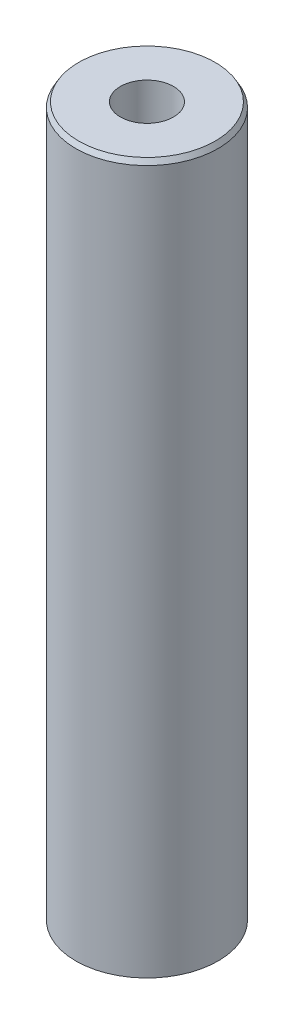
ISO-10303-21;
HEADER;
FILE_DESCRIPTION(('STEP AP214'),'2;1');
FILE_NAME('part.step','',(''),(''),'','','');
FILE_SCHEMA(('AUTOMOTIVE_DESIGN { 1 0 10303 214 1 1 1 1 }'));
ENDSEC;
DATA;
#1=APPLICATION_CONTEXT('core data for automotive mechanical design processes');
#2=APPLICATION_PROTOCOL_DEFINITION('international standard','automotive_design',2000,#1);
#3=PRODUCT_CONTEXT('',#1,'mechanical');
#4=PRODUCT('Part','Part','',(#3));
#5=PRODUCT_RELATED_PRODUCT_CATEGORY('part','',(#4));
#6=PRODUCT_DEFINITION_FORMATION('','',#4);
#7=PRODUCT_DEFINITION_CONTEXT('part definition',#1,'design');
#8=PRODUCT_DEFINITION('design','',#6,#7);
#9=PRODUCT_DEFINITION_SHAPE('','',#8);
#10=(LENGTH_UNIT() NAMED_UNIT(*) SI_UNIT(.MILLI.,.METRE.));
#11=(NAMED_UNIT(*) PLANE_ANGLE_UNIT() SI_UNIT($,.RADIAN.));
#12=(NAMED_UNIT(*) SI_UNIT($,.STERADIAN.) SOLID_ANGLE_UNIT());
#13=UNCERTAINTY_MEASURE_WITH_UNIT(LENGTH_MEASURE(1.E-05),#10,'distance_accuracy_value','');
#14=(GEOMETRIC_REPRESENTATION_CONTEXT(3) GLOBAL_UNCERTAINTY_ASSIGNED_CONTEXT((#13)) GLOBAL_UNIT_ASSIGNED_CONTEXT((#10,
#11,#12)) REPRESENTATION_CONTEXT('',''));
#15=CARTESIAN_POINT('',(0.,0.,0.));
#16=DIRECTION('',(0.,0.,1.));
#17=DIRECTION('',(1.,0.,0.));
#18=AXIS2_PLACEMENT_3D('',#15,#16,#17);
#19=CARTESIAN_POINT('',(0.,600.,0.));
#20=DIRECTION('',(0.,-1.,0.));
#21=DIRECTION('',(0.,0.,-1.));
#22=AXIS2_PLACEMENT_3D('',#19,#20,#21);
#23=CYLINDRICAL_SURFACE('',#22,60.);
#24=CARTESIAN_POINT('',(0.,595.762489300992,0.));
#25=DIRECTION('',(0.,1.,0.));
#26=DIRECTION('',(0.,0.,1.));
#27=AXIS2_PLACEMENT_3D('',#24,#25,#26);
#28=CIRCLE('',#27,60.);
#29=CARTESIAN_POINT('',(0.,595.762489300992,60.));
#30=VERTEX_POINT('',#29);
#31=EDGE_CURVE('E50',#30,#30,#28,.F.);
#32=ORIENTED_EDGE('',*,*,#31,.T.);
#33=EDGE_LOOP('',(#32));
#34=FACE_BOUND('',#33,.T.);
#35=CARTESIAN_POINT('',(0.,2.4465279427659,0.));
#36=DIRECTION('',(0.,1.,0.));
#37=DIRECTION('',(0.,0.,1.));
#38=AXIS2_PLACEMENT_3D('',#35,#36,#37);
#39=CIRCLE('',#38,60.);
#40=CARTESIAN_POINT('',(0.,2.4465279427659,60.));
#41=VERTEX_POINT('',#40);
#42=EDGE_CURVE('E51',#41,#41,#39,.T.);
#43=ORIENTED_EDGE('',*,*,#42,.T.);
#44=EDGE_LOOP('',(#43));
#45=FACE_BOUND('',#44,.T.);
#46=ADVANCED_FACE('F39',(#34,#45),#23,.T.);
#47=CARTESIAN_POINT('',(0.,600.,0.));
#48=DIRECTION('',(0.,1.,0.));
#49=DIRECTION('',(0.,0.,1.));
#50=AXIS2_PLACEMENT_3D('',#47,#48,#49);
#51=PLANE('',#50);
#52=CARTESIAN_POINT('',(0.,600.,0.));
#53=DIRECTION('',(0.,1.,0.));
#54=DIRECTION('',(0.,0.,1.));
#55=AXIS2_PLACEMENT_3D('',#52,#53,#54);
#56=CIRCLE('',#55,57.5534720572341);
#57=CARTESIAN_POINT('',(0.,600.,57.5534720572341));
#58=VERTEX_POINT('',#57);
#59=EDGE_CURVE('E54',#58,#58,#56,.T.);
#60=ORIENTED_EDGE('',*,*,#59,.T.);
#61=EDGE_LOOP('',(#60));
#62=FACE_BOUND('',#61,.T.);
#63=CARTESIAN_POINT('',(0.,600.,0.));
#64=DIRECTION('',(0.,1.,0.));
#65=DIRECTION('',(0.,0.,1.));
#66=AXIS2_PLACEMENT_3D('',#63,#64,#65);
#67=CIRCLE('',#66,22.3790649528476);
#68=CARTESIAN_POINT('',(0.,600.,22.3790649528476));
#69=VERTEX_POINT('',#68);
#70=EDGE_CURVE('E58',#69,#69,#67,.T.);
#71=ORIENTED_EDGE('',*,*,#70,.F.);
#72=EDGE_LOOP('',(#71));
#73=FACE_BOUND('',#72,.T.);
#74=ADVANCED_FACE('F69',(#62,#73),#51,.T.);
#75=CARTESIAN_POINT('',(0.,0.,0.));
#76=DIRECTION('',(0.,1.,0.));
#77=DIRECTION('',(0.,0.,1.));
#78=AXIS2_PLACEMENT_3D('',#75,#76,#77);
#79=PLANE('',#78);
#80=CARTESIAN_POINT('',(0.,0.,0.));
#81=DIRECTION('',(0.,1.,0.));
#82=DIRECTION('',(0.,0.,1.));
#83=AXIS2_PLACEMENT_3D('',#80,#81,#82);
#84=CIRCLE('',#83,55.7624893009924);
#85=CARTESIAN_POINT('',(0.,0.,55.7624893009924));
#86=VERTEX_POINT('',#85);
#87=EDGE_CURVE('E10',#86,#86,#84,.F.);
#88=ORIENTED_EDGE('',*,*,#87,.T.);
#89=EDGE_LOOP('',(#88));
#90=FACE_BOUND('',#89,.T.);
#91=CARTESIAN_POINT('',(0.,0.,0.));
#92=DIRECTION('',(0.,1.,0.));
#93=DIRECTION('',(0.,0.,1.));
#94=AXIS2_PLACEMENT_3D('',#91,#92,#93);
#95=CIRCLE('',#94,22.3790649528476);
#96=CARTESIAN_POINT('',(0.,0.,22.3790649528476));
#97=VERTEX_POINT('',#96);
#98=EDGE_CURVE('E63',#97,#97,#95,.T.);
#99=ORIENTED_EDGE('',*,*,#98,.T.);
#100=EDGE_LOOP('',(#99));
#101=FACE_BOUND('',#100,.T.);
#102=ADVANCED_FACE('F75',(#90,#101),#79,.F.);
#103=CARTESIAN_POINT('',(0.,600.,0.));
#104=DIRECTION('',(0.,-1.,0.));
#105=DIRECTION('',(0.,0.,-1.));
#106=AXIS2_PLACEMENT_3D('',#103,#104,#105);
#107=CYLINDRICAL_SURFACE('',#106,22.3790649528476);
#108=ORIENTED_EDGE('',*,*,#70,.T.);
#109=EDGE_LOOP('',(#108));
#110=FACE_BOUND('',#109,.T.);
#111=ORIENTED_EDGE('',*,*,#98,.F.);
#112=EDGE_LOOP('',(#111));
#113=FACE_BOUND('',#112,.T.);
#114=ADVANCED_FACE('F70',(#110,#113),#107,.F.);
#115=CARTESIAN_POINT('',(0.,600.,0.));
#116=DIRECTION('',(0.,-1.,0.));
#117=DIRECTION('',(0.,0.,-1.));
#118=AXIS2_PLACEMENT_3D('',#115,#116,#117);
#119=CONICAL_SURFACE('',#118,57.5534720572341,0.523598775598291);
#120=ORIENTED_EDGE('',*,*,#31,.F.);
#121=EDGE_LOOP('',(#120));
#122=FACE_BOUND('',#121,.T.);
#123=ORIENTED_EDGE('',*,*,#59,.F.);
#124=EDGE_LOOP('',(#123));
#125=FACE_BOUND('',#124,.T.);
#126=ADVANCED_FACE('F81',(#122,#125),#119,.T.);
#127=CARTESIAN_POINT('',(0.,2.4465279427659,0.));
#128=DIRECTION('',(0.,1.,0.));
#129=DIRECTION('',(0.,0.,1.));
#130=AXIS2_PLACEMENT_3D('',#127,#128,#129);
#131=CONICAL_SURFACE('',#130,60.,1.04719755119661);
#132=ORIENTED_EDGE('',*,*,#87,.F.);
#133=EDGE_LOOP('',(#132));
#134=FACE_BOUND('',#133,.T.);
#135=ORIENTED_EDGE('',*,*,#42,.F.);
#136=EDGE_LOOP('',(#135));
#137=FACE_BOUND('',#136,.T.);
#138=ADVANCED_FACE('F45',(#134,#137),#131,.T.);
#139=CLOSED_SHELL('',(#46,#74,#102,#114,#126,#138));
#140=MANIFOLD_SOLID_BREP('B2',#139);
#141=ADVANCED_BREP_SHAPE_REPRESENTATION('',(#18,#140),#14);
#142=SHAPE_DEFINITION_REPRESENTATION(#9,#141);
ENDSEC;
END-ISO-10303-21;
